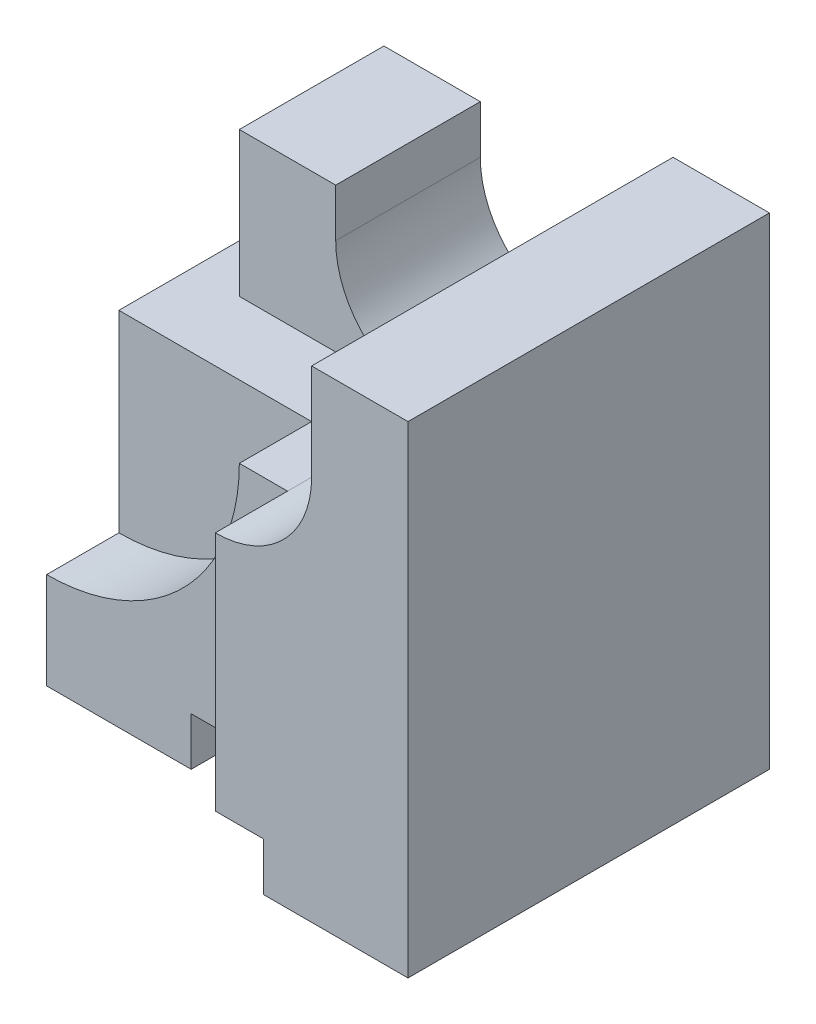
ISO-10303-21;
HEADER;
FILE_DESCRIPTION(('STEP AP214'),'2;1');
FILE_NAME('part.step','',(''),(''),'','','');
FILE_SCHEMA(('AUTOMOTIVE_DESIGN { 1 0 10303 214 1 1 1 1 }'));
ENDSEC;
DATA;
#1=APPLICATION_CONTEXT('core data for automotive mechanical design processes');
#2=APPLICATION_PROTOCOL_DEFINITION('international standard','automotive_design',2000,#1);
#3=PRODUCT_CONTEXT('',#1,'mechanical');
#4=PRODUCT('Part','Part','',(#3));
#5=PRODUCT_RELATED_PRODUCT_CATEGORY('part','',(#4));
#6=PRODUCT_DEFINITION_FORMATION('','',#4);
#7=PRODUCT_DEFINITION_CONTEXT('part definition',#1,'design');
#8=PRODUCT_DEFINITION('design','',#6,#7);
#9=PRODUCT_DEFINITION_SHAPE('','',#8);
#10=(LENGTH_UNIT() NAMED_UNIT(*) SI_UNIT(.MILLI.,.METRE.));
#11=(NAMED_UNIT(*) PLANE_ANGLE_UNIT() SI_UNIT($,.RADIAN.));
#12=(NAMED_UNIT(*) SI_UNIT($,.STERADIAN.) SOLID_ANGLE_UNIT());
#13=UNCERTAINTY_MEASURE_WITH_UNIT(LENGTH_MEASURE(1.E-05),#10,'distance_accuracy_value','');
#14=(GEOMETRIC_REPRESENTATION_CONTEXT(3) GLOBAL_UNCERTAINTY_ASSIGNED_CONTEXT((#13)) GLOBAL_UNIT_ASSIGNED_CONTEXT((#10,
#11,#12)) REPRESENTATION_CONTEXT('',''));
#15=CARTESIAN_POINT('',(0.,0.,0.));
#16=DIRECTION('',(0.,0.,1.));
#17=DIRECTION('',(1.,0.,0.));
#18=AXIS2_PLACEMENT_3D('',#15,#16,#17);
#19=CARTESIAN_POINT('',(5.,8.,3.75));
#20=DIRECTION('',(0.,0.,-1.));
#21=DIRECTION('',(-1.,0.,0.));
#22=AXIS2_PLACEMENT_3D('',#19,#20,#21);
#23=CYLINDRICAL_SURFACE('',#22,2.00000000000001);
#24=DIRECTION('',(0.,0.,1.));
#25=VECTOR('',#24,1.);
#26=CARTESIAN_POINT('',(5.,6.,-0.75));
#27=LINE('',#26,#25);
#28=CARTESIAN_POINT('',(5.,6.,-0.75));
#29=VERTEX_POINT('',#28);
#30=CARTESIAN_POINT('',(5.,6.,2.25));
#31=VERTEX_POINT('',#30);
#32=EDGE_CURVE('E208',#29,#31,#27,.T.);
#33=ORIENTED_EDGE('',*,*,#32,.T.);
#34=DIRECTION('',(0.,0.,-1.));
#35=VECTOR('',#34,1.);
#36=CARTESIAN_POINT('',(5.,6.,3.75));
#37=LINE('',#36,#35);
#38=CARTESIAN_POINT('',(5.,6.,3.75));
#39=VERTEX_POINT('',#38);
#40=EDGE_CURVE('E195',#39,#31,#37,.T.);
#41=ORIENTED_EDGE('',*,*,#40,.F.);
#42=CARTESIAN_POINT('',(5.,8.,3.75));
#43=DIRECTION('',(0.,0.,1.));
#44=DIRECTION('',(1.,0.,0.));
#45=AXIS2_PLACEMENT_3D('',#42,#43,#44);
#46=CIRCLE('',#45,2.00000000000001);
#47=CARTESIAN_POINT('',(7.,8.,3.75));
#48=VERTEX_POINT('',#47);
#49=EDGE_CURVE('E219',#39,#48,#46,.T.);
#50=ORIENTED_EDGE('',*,*,#49,.T.);
#51=DIRECTION('',(0.,0.,-1.));
#52=VECTOR('',#51,1.);
#53=CARTESIAN_POINT('',(7.,8.,3.75));
#54=LINE('',#53,#52);
#55=CARTESIAN_POINT('',(7.,8.,-3.75));
#56=VERTEX_POINT('',#55);
#57=EDGE_CURVE('E237',#48,#56,#54,.T.);
#58=ORIENTED_EDGE('',*,*,#57,.T.);
#59=CARTESIAN_POINT('',(5.,8.,-3.75));
#60=DIRECTION('',(0.,0.,1.));
#61=DIRECTION('',(1.,0.,0.));
#62=AXIS2_PLACEMENT_3D('',#59,#60,#61);
#63=CIRCLE('',#62,2.00000000000001);
#64=CARTESIAN_POINT('',(2.99999999999999,8.,-3.75));
#65=VERTEX_POINT('',#64);
#66=EDGE_CURVE('E218',#65,#56,#63,.T.);
#67=ORIENTED_EDGE('',*,*,#66,.F.);
#68=DIRECTION('',(0.,0.,-1.));
#69=VECTOR('',#68,1.);
#70=CARTESIAN_POINT('',(2.99999999999999,8.,3.75));
#71=LINE('',#70,#69);
#72=CARTESIAN_POINT('',(2.99999999999999,8.,-0.75));
#73=VERTEX_POINT('',#72);
#74=EDGE_CURVE('E301',#73,#65,#71,.T.);
#75=ORIENTED_EDGE('',*,*,#74,.F.);
#76=CARTESIAN_POINT('',(5.,8.,-0.75));
#77=DIRECTION('',(0.,0.,-1.));
#78=DIRECTION('',(-1.,0.,0.));
#79=AXIS2_PLACEMENT_3D('',#76,#77,#78);
#80=CIRCLE('',#79,2.00000000000001);
#81=EDGE_CURVE('E216',#29,#73,#80,.T.);
#82=ORIENTED_EDGE('',*,*,#81,.F.);
#83=EDGE_LOOP('',(#33,#41,#50,#58,#67,#75,#82));
#84=FACE_BOUND('',#83,.T.);
#85=ADVANCED_FACE('F35',(#84),#23,.F.);
#86=CARTESIAN_POINT('',(2.99999999999987,0.,3.75));
#87=DIRECTION('',(1.,0.,0.));
#88=DIRECTION('',(0.,1.,0.));
#89=AXIS2_PLACEMENT_3D('',#86,#87,#88);
#90=PLANE('',#89);
#91=DIRECTION('',(0.,1.,0.));
#92=VECTOR('',#91,1.);
#93=CARTESIAN_POINT('',(2.99999999999987,0.,-0.75));
#94=LINE('',#93,#92);
#95=CARTESIAN_POINT('',(3.,9.,-0.75));
#96=VERTEX_POINT('',#95);
#97=EDGE_CURVE('E214',#73,#96,#94,.T.);
#98=ORIENTED_EDGE('',*,*,#97,.F.);
#99=ORIENTED_EDGE('',*,*,#74,.T.);
#100=DIRECTION('',(0.,-1.,0.));
#101=VECTOR('',#100,1.);
#102=CARTESIAN_POINT('',(2.99999999999987,0.,-3.75));
#103=LINE('',#102,#101);
#104=CARTESIAN_POINT('',(3.,9.,-3.75));
#105=VERTEX_POINT('',#104);
#106=EDGE_CURVE('E240',#105,#65,#103,.T.);
#107=ORIENTED_EDGE('',*,*,#106,.F.);
#108=DIRECTION('',(0.,0.,-1.));
#109=VECTOR('',#108,1.);
#110=CARTESIAN_POINT('',(3.,9.,3.75));
#111=LINE('',#110,#109);
#112=EDGE_CURVE('E299',#96,#105,#111,.T.);
#113=ORIENTED_EDGE('',*,*,#112,.F.);
#114=EDGE_LOOP('',(#98,#99,#107,#113));
#115=FACE_BOUND('',#114,.T.);
#116=ADVANCED_FACE('F326',(#115),#90,.T.);
#117=CARTESIAN_POINT('',(0.,9.,3.75));
#118=DIRECTION('',(0.,-1.,0.));
#119=DIRECTION('',(1.,0.,0.));
#120=AXIS2_PLACEMENT_3D('',#117,#118,#119);
#121=PLANE('',#120);
#122=DIRECTION('',(0.,0.,-1.));
#123=VECTOR('',#122,1.);
#124=CARTESIAN_POINT('',(1.,9.,3.75));
#125=LINE('',#124,#123);
#126=CARTESIAN_POINT('',(1.,9.,-0.75));
#127=VERTEX_POINT('',#126);
#128=CARTESIAN_POINT('',(1.,9.,-3.75));
#129=VERTEX_POINT('',#128);
#130=EDGE_CURVE('E297',#127,#129,#125,.T.);
#131=ORIENTED_EDGE('',*,*,#130,.F.);
#132=DIRECTION('',(1.,0.,0.));
#133=VECTOR('',#132,1.);
#134=CARTESIAN_POINT('',(0.,9.,-0.75));
#135=LINE('',#134,#133);
#136=EDGE_CURVE('E211',#127,#96,#135,.T.);
#137=ORIENTED_EDGE('',*,*,#136,.T.);
#138=ORIENTED_EDGE('',*,*,#112,.T.);
#139=DIRECTION('',(-1.,0.,0.));
#140=VECTOR('',#139,1.);
#141=CARTESIAN_POINT('',(0.,9.,-3.75));
#142=LINE('',#141,#140);
#143=EDGE_CURVE('E243',#105,#129,#142,.T.);
#144=ORIENTED_EDGE('',*,*,#143,.T.);
#145=EDGE_LOOP('',(#131,#137,#138,#144));
#146=FACE_BOUND('',#145,.T.);
#147=ADVANCED_FACE('F331',(#146),#121,.F.);
#148=CARTESIAN_POINT('',(1.,0.,3.75));
#149=DIRECTION('',(1.,0.,0.));
#150=DIRECTION('',(0.,1.,0.));
#151=AXIS2_PLACEMENT_3D('',#148,#149,#150);
#152=PLANE('',#151);
#153=DIRECTION('',(0.,0.,-1.));
#154=VECTOR('',#153,1.);
#155=CARTESIAN_POINT('',(1.,6.,3.75));
#156=LINE('',#155,#154);
#157=CARTESIAN_POINT('',(1.,6.,-0.75));
#158=VERTEX_POINT('',#157);
#159=CARTESIAN_POINT('',(1.,6.,-3.75));
#160=VERTEX_POINT('',#159);
#161=EDGE_CURVE('E295',#158,#160,#156,.T.);
#162=ORIENTED_EDGE('',*,*,#161,.F.);
#163=DIRECTION('',(0.,1.,0.));
#164=VECTOR('',#163,1.);
#165=CARTESIAN_POINT('',(1.,6.,-0.75));
#166=LINE('',#165,#164);
#167=EDGE_CURVE('E202',#158,#127,#166,.T.);
#168=ORIENTED_EDGE('',*,*,#167,.T.);
#169=ORIENTED_EDGE('',*,*,#130,.T.);
#170=DIRECTION('',(0.,-1.,0.));
#171=VECTOR('',#170,1.);
#172=CARTESIAN_POINT('',(1.,0.,-3.75));
#173=LINE('',#172,#171);
#174=EDGE_CURVE('E246',#129,#160,#173,.T.);
#175=ORIENTED_EDGE('',*,*,#174,.T.);
#176=EDGE_LOOP('',(#162,#168,#169,#175));
#177=FACE_BOUND('',#176,.T.);
#178=ADVANCED_FACE('F334',(#177),#152,.F.);
#179=CARTESIAN_POINT('',(0.,6.,3.75));
#180=DIRECTION('',(0.,1.,0.));
#181=DIRECTION('',(0.,0.,1.));
#182=AXIS2_PLACEMENT_3D('',#179,#180,#181);
#183=PLANE('',#182);
#184=DIRECTION('',(0.,0.,1.));
#185=VECTOR('',#184,1.);
#186=CARTESIAN_POINT('',(4.,6.,0.75));
#187=LINE('',#186,#185);
#188=CARTESIAN_POINT('',(4.,6.,0.75));
#189=VERTEX_POINT('',#188);
#190=CARTESIAN_POINT('',(4.,6.,2.25));
#191=VERTEX_POINT('',#190);
#192=EDGE_CURVE('E161',#189,#191,#187,.T.);
#193=ORIENTED_EDGE('',*,*,#192,.T.);
#194=DIRECTION('',(-1.,0.,0.));
#195=VECTOR('',#194,1.);
#196=CARTESIAN_POINT('',(0.,6.,2.25));
#197=LINE('',#196,#195);
#198=EDGE_CURVE('E200',#31,#191,#197,.T.);
#199=ORIENTED_EDGE('',*,*,#198,.F.);
#200=ORIENTED_EDGE('',*,*,#32,.F.);
#201=DIRECTION('',(1.,0.,0.));
#202=VECTOR('',#201,1.);
#203=CARTESIAN_POINT('',(1.,6.,-0.75));
#204=LINE('',#203,#202);
#205=EDGE_CURVE('E205',#158,#29,#204,.T.);
#206=ORIENTED_EDGE('',*,*,#205,.F.);
#207=ORIENTED_EDGE('',*,*,#161,.T.);
#208=DIRECTION('',(1.,0.,0.));
#209=VECTOR('',#208,1.);
#210=CARTESIAN_POINT('',(0.,6.,-3.75));
#211=LINE('',#210,#209);
#212=CARTESIAN_POINT('',(0.,6.,-3.75));
#213=VERTEX_POINT('',#212);
#214=EDGE_CURVE('E249',#213,#160,#211,.T.);
#215=ORIENTED_EDGE('',*,*,#214,.F.);
#216=DIRECTION('',(0.,0.,-1.));
#217=VECTOR('',#216,1.);
#218=CARTESIAN_POINT('',(0.,6.,3.75));
#219=LINE('',#218,#217);
#220=CARTESIAN_POINT('',(0.,6.,0.75));
#221=VERTEX_POINT('',#220);
#222=EDGE_CURVE('E181',#221,#213,#219,.T.);
#223=ORIENTED_EDGE('',*,*,#222,.F.);
#224=DIRECTION('',(-1.,0.,0.));
#225=VECTOR('',#224,1.);
#226=CARTESIAN_POINT('',(4.,6.,0.75));
#227=LINE('',#226,#225);
#228=EDGE_CURVE('E175',#189,#221,#227,.T.);
#229=ORIENTED_EDGE('',*,*,#228,.F.);
#230=EDGE_LOOP('',(#193,#199,#200,#206,#207,#215,#223,#229));
#231=FACE_BOUND('',#230,.T.);
#232=ADVANCED_FACE('F179',(#231),#183,.T.);
#233=CARTESIAN_POINT('',(0.,0.,3.75));
#234=DIRECTION('',(-1.,0.,0.));
#235=DIRECTION('',(0.,0.,1.));
#236=AXIS2_PLACEMENT_3D('',#233,#234,#235);
#237=PLANE('',#236);
#238=DIRECTION('',(0.,0.,1.));
#239=VECTOR('',#238,1.);
#240=CARTESIAN_POINT('',(0.,2.,0.75));
#241=LINE('',#240,#239);
#242=CARTESIAN_POINT('',(0.,2.,0.75));
#243=VERTEX_POINT('',#242);
#244=CARTESIAN_POINT('',(0.,2.,2.25));
#245=VERTEX_POINT('',#244);
#246=EDGE_CURVE('E49',#243,#245,#241,.T.);
#247=ORIENTED_EDGE('',*,*,#246,.F.);
#248=DIRECTION('',(0.,-1.,0.));
#249=VECTOR('',#248,1.);
#250=CARTESIAN_POINT('',(0.,6.,0.75));
#251=LINE('',#250,#249);
#252=EDGE_CURVE('E171',#221,#243,#251,.T.);
#253=ORIENTED_EDGE('',*,*,#252,.F.);
#254=ORIENTED_EDGE('',*,*,#222,.T.);
#255=DIRECTION('',(0.,1.,0.));
#256=VECTOR('',#255,1.);
#257=CARTESIAN_POINT('',(0.,0.,-3.75));
#258=LINE('',#257,#256);
#259=CARTESIAN_POINT('',(0.,0.,-3.75));
#260=VERTEX_POINT('',#259);
#261=EDGE_CURVE('E252',#260,#213,#258,.T.);
#262=ORIENTED_EDGE('',*,*,#261,.F.);
#263=DIRECTION('',(0.,0.,-1.));
#264=VECTOR('',#263,1.);
#265=CARTESIAN_POINT('',(0.,0.,3.75));
#266=LINE('',#265,#264);
#267=CARTESIAN_POINT('',(0.,0.,2.25));
#268=VERTEX_POINT('',#267);
#269=EDGE_CURVE('E292',#268,#260,#266,.T.);
#270=ORIENTED_EDGE('',*,*,#269,.F.);
#271=DIRECTION('',(0.,-1.,0.));
#272=VECTOR('',#271,1.);
#273=CARTESIAN_POINT('',(0.,0.,2.25));
#274=LINE('',#273,#272);
#275=EDGE_CURVE('E186',#245,#268,#274,.T.);
#276=ORIENTED_EDGE('',*,*,#275,.F.);
#277=EDGE_LOOP('',(#247,#253,#254,#262,#270,#276));
#278=FACE_BOUND('',#277,.T.);
#279=ADVANCED_FACE('F372',(#278),#237,.T.);
#280=CARTESIAN_POINT('',(0.,0.,3.75));
#281=DIRECTION('',(0.,1.,0.));
#282=DIRECTION('',(0.,0.,1.));
#283=AXIS2_PLACEMENT_3D('',#280,#281,#282);
#284=PLANE('',#283);
#285=DIRECTION('',(0.,0.,-1.));
#286=VECTOR('',#285,1.);
#287=CARTESIAN_POINT('',(3.,0.,3.75));
#288=LINE('',#287,#286);
#289=CARTESIAN_POINT('',(3.,0.,2.25));
#290=VERTEX_POINT('',#289);
#291=CARTESIAN_POINT('',(3.,0.,-3.75));
#292=VERTEX_POINT('',#291);
#293=EDGE_CURVE('E290',#290,#292,#288,.T.);
#294=ORIENTED_EDGE('',*,*,#293,.F.);
#295=DIRECTION('',(1.,0.,0.));
#296=VECTOR('',#295,1.);
#297=CARTESIAN_POINT('',(0.,0.,2.25));
#298=LINE('',#297,#296);
#299=EDGE_CURVE('E189',#268,#290,#298,.T.);
#300=ORIENTED_EDGE('',*,*,#299,.F.);
#301=ORIENTED_EDGE('',*,*,#269,.T.);
#302=DIRECTION('',(1.,0.,0.));
#303=VECTOR('',#302,1.);
#304=CARTESIAN_POINT('',(0.,0.,-3.75));
#305=LINE('',#304,#303);
#306=EDGE_CURVE('E255',#260,#292,#305,.T.);
#307=ORIENTED_EDGE('',*,*,#306,.T.);
#308=EDGE_LOOP('',(#294,#300,#301,#307));
#309=FACE_BOUND('',#308,.T.);
#310=ADVANCED_FACE('F368',(#309),#284,.F.);
#311=CARTESIAN_POINT('',(3.,0.,3.75));
#312=DIRECTION('',(-1.,0.,0.));
#313=DIRECTION('',(0.,0.,1.));
#314=AXIS2_PLACEMENT_3D('',#311,#312,#313);
#315=PLANE('',#314);
#316=DIRECTION('',(0.,0.,-1.));
#317=VECTOR('',#316,1.);
#318=CARTESIAN_POINT('',(3.,1.,3.75));
#319=LINE('',#318,#317);
#320=CARTESIAN_POINT('',(3.,1.,2.25));
#321=VERTEX_POINT('',#320);
#322=CARTESIAN_POINT('',(3.,1.,-3.75));
#323=VERTEX_POINT('',#322);
#324=EDGE_CURVE('E288',#321,#323,#319,.T.);
#325=ORIENTED_EDGE('',*,*,#324,.F.);
#326=DIRECTION('',(0.,-1.,0.));
#327=VECTOR('',#326,1.);
#328=CARTESIAN_POINT('',(3.,0.,2.25));
#329=LINE('',#328,#327);
#330=EDGE_CURVE('E197',#321,#290,#329,.T.);
#331=ORIENTED_EDGE('',*,*,#330,.T.);
#332=ORIENTED_EDGE('',*,*,#293,.T.);
#333=DIRECTION('',(0.,1.,0.));
#334=VECTOR('',#333,1.);
#335=CARTESIAN_POINT('',(3.,0.,-3.75));
#336=LINE('',#335,#334);
#337=EDGE_CURVE('E258',#292,#323,#336,.T.);
#338=ORIENTED_EDGE('',*,*,#337,.T.);
#339=EDGE_LOOP('',(#325,#331,#332,#338));
#340=FACE_BOUND('',#339,.T.);
#341=ADVANCED_FACE('F364',(#340),#315,.F.);
#342=CARTESIAN_POINT('',(0.,1.,3.75));
#343=DIRECTION('',(0.,1.,0.));
#344=DIRECTION('',(0.,0.,1.));
#345=AXIS2_PLACEMENT_3D('',#342,#343,#344);
#346=PLANE('',#345);
#347=DIRECTION('',(1.,0.,0.));
#348=VECTOR('',#347,1.);
#349=CARTESIAN_POINT('',(0.,1.,3.75));
#350=LINE('',#349,#348);
#351=CARTESIAN_POINT('',(5.,1.,3.75));
#352=VERTEX_POINT('',#351);
#353=CARTESIAN_POINT('',(6.,1.,3.75));
#354=VERTEX_POINT('',#353);
#355=EDGE_CURVE('E221',#352,#354,#350,.T.);
#356=ORIENTED_EDGE('',*,*,#355,.F.);
#357=DIRECTION('',(0.,0.,-1.));
#358=VECTOR('',#357,1.);
#359=CARTESIAN_POINT('',(5.,1.,3.75));
#360=LINE('',#359,#358);
#361=CARTESIAN_POINT('',(5.,1.,2.25));
#362=VERTEX_POINT('',#361);
#363=EDGE_CURVE('E57',#352,#362,#360,.T.);
#364=ORIENTED_EDGE('',*,*,#363,.T.);
#365=DIRECTION('',(-1.,0.,0.));
#366=VECTOR('',#365,1.);
#367=CARTESIAN_POINT('',(0.,1.,2.25));
#368=LINE('',#367,#366);
#369=EDGE_CURVE('E11',#362,#321,#368,.T.);
#370=ORIENTED_EDGE('',*,*,#369,.T.);
#371=ORIENTED_EDGE('',*,*,#324,.T.);
#372=DIRECTION('',(1.,0.,0.));
#373=VECTOR('',#372,1.);
#374=CARTESIAN_POINT('',(0.,1.,-3.75));
#375=LINE('',#374,#373);
#376=CARTESIAN_POINT('',(6.,1.,-3.75));
#377=VERTEX_POINT('',#376);
#378=EDGE_CURVE('E262',#323,#377,#375,.T.);
#379=ORIENTED_EDGE('',*,*,#378,.T.);
#380=DIRECTION('',(0.,0.,-1.));
#381=VECTOR('',#380,1.);
#382=CARTESIAN_POINT('',(6.,1.,3.75));
#383=LINE('',#382,#381);
#384=EDGE_CURVE('E286',#354,#377,#383,.T.);
#385=ORIENTED_EDGE('',*,*,#384,.F.);
#386=EDGE_LOOP('',(#356,#364,#370,#371,#379,#385));
#387=FACE_BOUND('',#386,.T.);
#388=ADVANCED_FACE('F340',(#387),#346,.F.);
#389=CARTESIAN_POINT('',(6.,0.,3.75));
#390=DIRECTION('',(-1.,0.,0.));
#391=DIRECTION('',(0.,0.,1.));
#392=AXIS2_PLACEMENT_3D('',#389,#390,#391);
#393=PLANE('',#392);
#394=DIRECTION('',(0.,1.,0.));
#395=VECTOR('',#394,1.);
#396=CARTESIAN_POINT('',(6.,0.,-3.75));
#397=LINE('',#396,#395);
#398=CARTESIAN_POINT('',(6.,0.,-3.75));
#399=VERTEX_POINT('',#398);
#400=EDGE_CURVE('E265',#399,#377,#397,.T.);
#401=ORIENTED_EDGE('',*,*,#400,.F.);
#402=DIRECTION('',(0.,0.,-1.));
#403=VECTOR('',#402,1.);
#404=CARTESIAN_POINT('',(6.,0.,3.75));
#405=LINE('',#404,#403);
#406=CARTESIAN_POINT('',(6.,0.,3.75));
#407=VERTEX_POINT('',#406);
#408=EDGE_CURVE('E284',#407,#399,#405,.T.);
#409=ORIENTED_EDGE('',*,*,#408,.F.);
#410=DIRECTION('',(0.,1.,0.));
#411=VECTOR('',#410,1.);
#412=CARTESIAN_POINT('',(6.,0.,3.75));
#413=LINE('',#412,#411);
#414=EDGE_CURVE('E226',#407,#354,#413,.T.);
#415=ORIENTED_EDGE('',*,*,#414,.T.);
#416=ORIENTED_EDGE('',*,*,#384,.T.);
#417=EDGE_LOOP('',(#401,#409,#415,#416));
#418=FACE_BOUND('',#417,.T.);
#419=ADVANCED_FACE('F348',(#418),#393,.T.);
#420=CARTESIAN_POINT('',(9.,0.,-3.75));
#421=VERTEX_POINT('',#420);
#422=EDGE_CURVE('E259',#399,#421,#305,.T.);
#423=ORIENTED_EDGE('',*,*,#422,.T.);
#424=DIRECTION('',(0.,0.,-1.));
#425=VECTOR('',#424,1.);
#426=CARTESIAN_POINT('',(9.,0.,3.75));
#427=LINE('',#426,#425);
#428=CARTESIAN_POINT('',(9.,0.,3.75));
#429=VERTEX_POINT('',#428);
#430=EDGE_CURVE('E281',#429,#421,#427,.T.);
#431=ORIENTED_EDGE('',*,*,#430,.F.);
#432=DIRECTION('',(1.,0.,0.));
#433=VECTOR('',#432,1.);
#434=CARTESIAN_POINT('',(0.,0.,3.75));
#435=LINE('',#434,#433);
#436=EDGE_CURVE('E223',#407,#429,#435,.T.);
#437=ORIENTED_EDGE('',*,*,#436,.F.);
#438=ORIENTED_EDGE('',*,*,#408,.T.);
#439=EDGE_LOOP('',(#423,#431,#437,#438));
#440=FACE_BOUND('',#439,.T.);
#441=ADVANCED_FACE('F351',(#440),#284,.F.);
#442=CARTESIAN_POINT('',(9.,0.,3.75));
#443=DIRECTION('',(-1.,0.,0.));
#444=DIRECTION('',(0.,0.,1.));
#445=AXIS2_PLACEMENT_3D('',#442,#443,#444);
#446=PLANE('',#445);
#447=DIRECTION('',(0.,1.,0.));
#448=VECTOR('',#447,1.);
#449=CARTESIAN_POINT('',(9.,0.,-3.75));
#450=LINE('',#449,#448);
#451=CARTESIAN_POINT('',(9.,10.,-3.75));
#452=VERTEX_POINT('',#451);
#453=EDGE_CURVE('E268',#421,#452,#450,.T.);
#454=ORIENTED_EDGE('',*,*,#453,.T.);
#455=DIRECTION('',(0.,0.,-1.));
#456=VECTOR('',#455,1.);
#457=CARTESIAN_POINT('',(9.,10.,3.75));
#458=LINE('',#457,#456);
#459=CARTESIAN_POINT('',(9.,10.,3.75));
#460=VERTEX_POINT('',#459);
#461=EDGE_CURVE('E279',#460,#452,#458,.T.);
#462=ORIENTED_EDGE('',*,*,#461,.F.);
#463=DIRECTION('',(0.,1.,0.));
#464=VECTOR('',#463,1.);
#465=CARTESIAN_POINT('',(9.,0.,3.75));
#466=LINE('',#465,#464);
#467=EDGE_CURVE('E225',#429,#460,#466,.T.);
#468=ORIENTED_EDGE('',*,*,#467,.F.);
#469=ORIENTED_EDGE('',*,*,#430,.T.);
#470=EDGE_LOOP('',(#454,#462,#468,#469));
#471=FACE_BOUND('',#470,.T.);
#472=ADVANCED_FACE('F356',(#471),#446,.F.);
#473=CARTESIAN_POINT('',(0.,10.,3.75));
#474=DIRECTION('',(0.,1.,0.));
#475=DIRECTION('',(0.,0.,1.));
#476=AXIS2_PLACEMENT_3D('',#473,#474,#475);
#477=PLANE('',#476);
#478=DIRECTION('',(1.,0.,0.));
#479=VECTOR('',#478,1.);
#480=CARTESIAN_POINT('',(0.,10.,-3.75));
#481=LINE('',#480,#479);
#482=CARTESIAN_POINT('',(7.,10.,-3.75));
#483=VERTEX_POINT('',#482);
#484=EDGE_CURVE('E271',#483,#452,#481,.T.);
#485=ORIENTED_EDGE('',*,*,#484,.F.);
#486=DIRECTION('',(0.,0.,-1.));
#487=VECTOR('',#486,1.);
#488=CARTESIAN_POINT('',(7.,10.,3.75));
#489=LINE('',#488,#487);
#490=CARTESIAN_POINT('',(7.,10.,3.75));
#491=VERTEX_POINT('',#490);
#492=EDGE_CURVE('E277',#491,#483,#489,.T.);
#493=ORIENTED_EDGE('',*,*,#492,.F.);
#494=DIRECTION('',(1.,0.,0.));
#495=VECTOR('',#494,1.);
#496=CARTESIAN_POINT('',(0.,10.,3.75));
#497=LINE('',#496,#495);
#498=EDGE_CURVE('E231',#491,#460,#497,.T.);
#499=ORIENTED_EDGE('',*,*,#498,.T.);
#500=ORIENTED_EDGE('',*,*,#461,.T.);
#501=EDGE_LOOP('',(#485,#493,#499,#500));
#502=FACE_BOUND('',#501,.T.);
#503=ADVANCED_FACE('F359',(#502),#477,.T.);
#504=CARTESIAN_POINT('',(7.,0.,3.75));
#505=DIRECTION('',(1.,0.,0.));
#506=DIRECTION('',(0.,0.,-1.));
#507=AXIS2_PLACEMENT_3D('',#504,#505,#506);
#508=PLANE('',#507);
#509=DIRECTION('',(0.,-1.,0.));
#510=VECTOR('',#509,1.);
#511=CARTESIAN_POINT('',(7.,0.,-3.75));
#512=LINE('',#511,#510);
#513=EDGE_CURVE('E222',#483,#56,#512,.T.);
#514=ORIENTED_EDGE('',*,*,#513,.T.);
#515=ORIENTED_EDGE('',*,*,#57,.F.);
#516=DIRECTION('',(0.,-1.,0.));
#517=VECTOR('',#516,1.);
#518=CARTESIAN_POINT('',(7.,0.,3.75));
#519=LINE('',#518,#517);
#520=EDGE_CURVE('E234',#491,#48,#519,.T.);
#521=ORIENTED_EDGE('',*,*,#520,.F.);
#522=ORIENTED_EDGE('',*,*,#492,.T.);
#523=EDGE_LOOP('',(#514,#515,#521,#522));
#524=FACE_BOUND('',#523,.T.);
#525=ADVANCED_FACE('F314',(#524),#508,.F.);
#526=CARTESIAN_POINT('',(0.,0.,3.75));
#527=DIRECTION('',(0.,0.,1.));
#528=DIRECTION('',(1.,0.,0.));
#529=AXIS2_PLACEMENT_3D('',#526,#527,#528);
#530=PLANE('',#529);
#531=DIRECTION('',(0.,1.,0.));
#532=VECTOR('',#531,1.);
#533=CARTESIAN_POINT('',(5.,0.,3.75));
#534=LINE('',#533,#532);
#535=EDGE_CURVE('E42',#352,#39,#534,.T.);
#536=ORIENTED_EDGE('',*,*,#535,.F.);
#537=ORIENTED_EDGE('',*,*,#355,.T.);
#538=ORIENTED_EDGE('',*,*,#414,.F.);
#539=ORIENTED_EDGE('',*,*,#436,.T.);
#540=ORIENTED_EDGE('',*,*,#467,.T.);
#541=ORIENTED_EDGE('',*,*,#498,.F.);
#542=ORIENTED_EDGE('',*,*,#520,.T.);
#543=ORIENTED_EDGE('',*,*,#49,.F.);
#544=EDGE_LOOP('',(#536,#537,#538,#539,#540,#541,#542,#543));
#545=FACE_BOUND('',#544,.T.);
#546=ADVANCED_FACE('F309',(#545),#530,.T.);
#547=CARTESIAN_POINT('',(0.,0.,-3.75));
#548=DIRECTION('',(0.,0.,1.));
#549=DIRECTION('',(1.,0.,0.));
#550=AXIS2_PLACEMENT_3D('',#547,#548,#549);
#551=PLANE('',#550);
#552=ORIENTED_EDGE('',*,*,#66,.T.);
#553=ORIENTED_EDGE('',*,*,#513,.F.);
#554=ORIENTED_EDGE('',*,*,#484,.T.);
#555=ORIENTED_EDGE('',*,*,#453,.F.);
#556=ORIENTED_EDGE('',*,*,#422,.F.);
#557=ORIENTED_EDGE('',*,*,#400,.T.);
#558=ORIENTED_EDGE('',*,*,#378,.F.);
#559=ORIENTED_EDGE('',*,*,#337,.F.);
#560=ORIENTED_EDGE('',*,*,#306,.F.);
#561=ORIENTED_EDGE('',*,*,#261,.T.);
#562=ORIENTED_EDGE('',*,*,#214,.T.);
#563=ORIENTED_EDGE('',*,*,#174,.F.);
#564=ORIENTED_EDGE('',*,*,#143,.F.);
#565=ORIENTED_EDGE('',*,*,#106,.T.);
#566=EDGE_LOOP('',(#552,#553,#554,#555,#556,#557,#558,#559,#560,#561,#562,#563,#564,#565));
#567=FACE_BOUND('',#566,.T.);
#568=ADVANCED_FACE('F321',(#567),#551,.F.);
#569=CARTESIAN_POINT('',(0.,0.,-0.75));
#570=DIRECTION('',(0.,0.,-1.));
#571=DIRECTION('',(-1.,0.,0.));
#572=AXIS2_PLACEMENT_3D('',#569,#570,#571);
#573=PLANE('',#572);
#574=ORIENTED_EDGE('',*,*,#81,.T.);
#575=ORIENTED_EDGE('',*,*,#97,.T.);
#576=ORIENTED_EDGE('',*,*,#136,.F.);
#577=ORIENTED_EDGE('',*,*,#167,.F.);
#578=ORIENTED_EDGE('',*,*,#205,.T.);
#579=EDGE_LOOP('',(#574,#575,#576,#577,#578));
#580=FACE_BOUND('',#579,.T.);
#581=ADVANCED_FACE('F328',(#580),#573,.F.);
#582=CARTESIAN_POINT('',(0.,0.,2.25));
#583=DIRECTION('',(0.,0.,-1.));
#584=DIRECTION('',(-1.,0.,0.));
#585=AXIS2_PLACEMENT_3D('',#582,#583,#584);
#586=PLANE('',#585);
#587=ORIENTED_EDGE('',*,*,#198,.T.);
#588=CARTESIAN_POINT('',(0.,6.,2.25));
#589=DIRECTION('',(0.,0.,1.));
#590=DIRECTION('',(-1.,0.,0.));
#591=AXIS2_PLACEMENT_3D('',#588,#589,#590);
#592=CIRCLE('',#591,4.);
#593=EDGE_CURVE('E166',#245,#191,#592,.T.);
#594=ORIENTED_EDGE('',*,*,#593,.F.);
#595=ORIENTED_EDGE('',*,*,#275,.T.);
#596=ORIENTED_EDGE('',*,*,#299,.T.);
#597=ORIENTED_EDGE('',*,*,#330,.F.);
#598=ORIENTED_EDGE('',*,*,#369,.F.);
#599=DIRECTION('',(0.,1.,0.));
#600=VECTOR('',#599,1.);
#601=CARTESIAN_POINT('',(5.,0.,2.25));
#602=LINE('',#601,#600);
#603=EDGE_CURVE('E191',#362,#31,#602,.T.);
#604=ORIENTED_EDGE('',*,*,#603,.T.);
#605=EDGE_LOOP('',(#587,#594,#595,#596,#597,#598,#604));
#606=FACE_BOUND('',#605,.T.);
#607=ADVANCED_FACE('F337',(#606),#586,.F.);
#608=CARTESIAN_POINT('',(5.,0.,2.25));
#609=DIRECTION('',(1.,0.,0.));
#610=DIRECTION('',(0.,0.,-1.));
#611=AXIS2_PLACEMENT_3D('',#608,#609,#610);
#612=PLANE('',#611);
#613=ORIENTED_EDGE('',*,*,#40,.T.);
#614=ORIENTED_EDGE('',*,*,#603,.F.);
#615=ORIENTED_EDGE('',*,*,#363,.F.);
#616=ORIENTED_EDGE('',*,*,#535,.T.);
#617=EDGE_LOOP('',(#613,#614,#615,#616));
#618=FACE_BOUND('',#617,.T.);
#619=ADVANCED_FACE('F303',(#618),#612,.F.);
#620=CARTESIAN_POINT('',(0.,6.,0.75));
#621=DIRECTION('',(0.,0.,1.));
#622=DIRECTION('',(1.,0.,0.));
#623=AXIS2_PLACEMENT_3D('',#620,#621,#622);
#624=CYLINDRICAL_SURFACE('',#623,4.);
#625=ORIENTED_EDGE('',*,*,#593,.T.);
#626=ORIENTED_EDGE('',*,*,#192,.F.);
#627=CARTESIAN_POINT('',(0.,6.,0.75));
#628=DIRECTION('',(0.,0.,1.));
#629=DIRECTION('',(-1.,0.,0.));
#630=AXIS2_PLACEMENT_3D('',#627,#628,#629);
#631=CIRCLE('',#630,4.);
#632=EDGE_CURVE('E164',#243,#189,#631,.T.);
#633=ORIENTED_EDGE('',*,*,#632,.F.);
#634=ORIENTED_EDGE('',*,*,#246,.T.);
#635=EDGE_LOOP('',(#625,#626,#633,#634));
#636=FACE_BOUND('',#635,.T.);
#637=ADVANCED_FACE('F163',(#636),#624,.F.);
#638=CARTESIAN_POINT('',(0.,6.,0.75));
#639=DIRECTION('',(0.,0.,-1.));
#640=DIRECTION('',(-1.,0.,0.));
#641=AXIS2_PLACEMENT_3D('',#638,#639,#640);
#642=PLANE('',#641);
#643=ORIENTED_EDGE('',*,*,#632,.T.);
#644=ORIENTED_EDGE('',*,*,#228,.T.);
#645=ORIENTED_EDGE('',*,*,#252,.T.);
#646=EDGE_LOOP('',(#643,#644,#645));
#647=FACE_BOUND('',#646,.T.);
#648=ADVANCED_FACE('F174',(#647),#642,.F.);
#649=CLOSED_SHELL('',(#85,#116,#147,#178,#232,#279,#310,#341,#388,#419,#441,#472,#503,#525,#546,
#568,#581,#607,#619,#637,#648));
#650=MANIFOLD_SOLID_BREP('B2',#649);
#651=ADVANCED_BREP_SHAPE_REPRESENTATION('',(#18,#650),#14);
#652=SHAPE_DEFINITION_REPRESENTATION(#9,#651);
ENDSEC;
END-ISO-10303-21;
